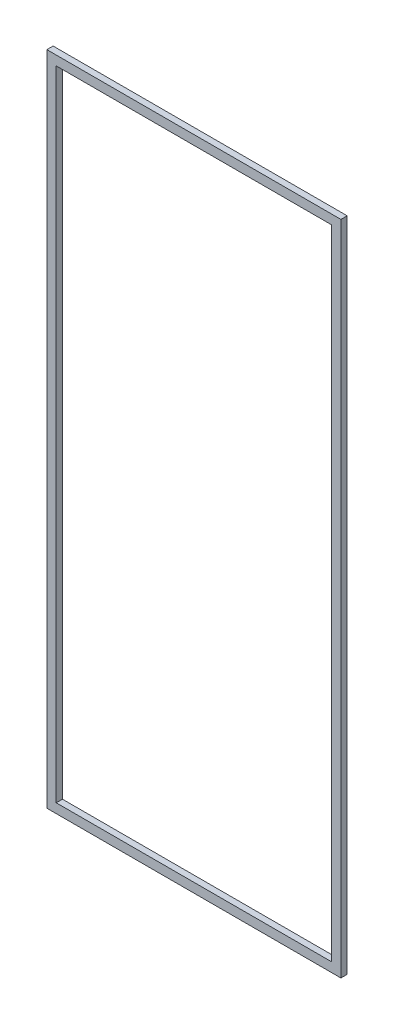
ISO-10303-21;
HEADER;
FILE_DESCRIPTION(('STEP AP214'),'2;1');
FILE_NAME('part.step','',(''),(''),'','','');
FILE_SCHEMA(('AUTOMOTIVE_DESIGN { 1 0 10303 214 1 1 1 1 }'));
ENDSEC;
DATA;
#1=APPLICATION_CONTEXT('core data for automotive mechanical design processes');
#2=APPLICATION_PROTOCOL_DEFINITION('international standard','automotive_design',2000,#1);
#3=PRODUCT_CONTEXT('',#1,'mechanical');
#4=PRODUCT('Part','Part','',(#3));
#5=PRODUCT_RELATED_PRODUCT_CATEGORY('part','',(#4));
#6=PRODUCT_DEFINITION_FORMATION('','',#4);
#7=PRODUCT_DEFINITION_CONTEXT('part definition',#1,'design');
#8=PRODUCT_DEFINITION('design','',#6,#7);
#9=PRODUCT_DEFINITION_SHAPE('','',#8);
#10=(LENGTH_UNIT() NAMED_UNIT(*) SI_UNIT(.MILLI.,.METRE.));
#11=(NAMED_UNIT(*) PLANE_ANGLE_UNIT() SI_UNIT($,.RADIAN.));
#12=(NAMED_UNIT(*) SI_UNIT($,.STERADIAN.) SOLID_ANGLE_UNIT());
#13=UNCERTAINTY_MEASURE_WITH_UNIT(LENGTH_MEASURE(1.E-05),#10,'distance_accuracy_value','');
#14=(GEOMETRIC_REPRESENTATION_CONTEXT(3) GLOBAL_UNCERTAINTY_ASSIGNED_CONTEXT((#13)) GLOBAL_UNIT_ASSIGNED_CONTEXT((#10,
#11,#12)) REPRESENTATION_CONTEXT('',''));
#15=CARTESIAN_POINT('',(0.,0.,0.));
#16=DIRECTION('',(0.,0.,1.));
#17=DIRECTION('',(1.,0.,0.));
#18=AXIS2_PLACEMENT_3D('',#15,#16,#17);
#19=CARTESIAN_POINT('',(0.,0.,10.));
#20=DIRECTION('',(0.,0.,1.));
#21=DIRECTION('',(1.,0.,0.));
#22=AXIS2_PLACEMENT_3D('',#19,#20,#21);
#23=PLANE('',#22);
#24=DIRECTION('',(0.,1.,0.));
#25=VECTOR('',#24,1.);
#26=CARTESIAN_POINT('',(235.,525.,10.));
#27=LINE('',#26,#25);
#28=CARTESIAN_POINT('',(235.,-525.,10.));
#29=VERTEX_POINT('',#28);
#30=CARTESIAN_POINT('',(235.,525.,10.));
#31=VERTEX_POINT('',#30);
#32=EDGE_CURVE('E159',#29,#31,#27,.T.);
#33=ORIENTED_EDGE('',*,*,#32,.T.);
#34=DIRECTION('',(-1.,0.,0.));
#35=VECTOR('',#34,1.);
#36=CARTESIAN_POINT('',(-235.,525.,10.));
#37=LINE('',#36,#35);
#38=CARTESIAN_POINT('',(-235.,525.,10.));
#39=VERTEX_POINT('',#38);
#40=EDGE_CURVE('E162',#31,#39,#37,.T.);
#41=ORIENTED_EDGE('',*,*,#40,.T.);
#42=DIRECTION('',(0.,-1.,0.));
#43=VECTOR('',#42,1.);
#44=CARTESIAN_POINT('',(-235.,525.,10.));
#45=LINE('',#44,#43);
#46=CARTESIAN_POINT('',(-235.,-525.,10.));
#47=VERTEX_POINT('',#46);
#48=EDGE_CURVE('E165',#39,#47,#45,.T.);
#49=ORIENTED_EDGE('',*,*,#48,.T.);
#50=DIRECTION('',(1.,0.,0.));
#51=VECTOR('',#50,1.);
#52=CARTESIAN_POINT('',(-235.,-525.,10.));
#53=LINE('',#52,#51);
#54=EDGE_CURVE('E167',#47,#29,#53,.T.);
#55=ORIENTED_EDGE('',*,*,#54,.T.);
#56=EDGE_LOOP('',(#33,#41,#49,#55));
#57=FACE_BOUND('',#56,.T.);
#58=DIRECTION('',(-1.,0.,0.));
#59=VECTOR('',#58,1.);
#60=CARTESIAN_POINT('',(-235.,510.,10.));
#61=LINE('',#60,#59);
#62=CARTESIAN_POINT('',(220.,510.,10.));
#63=VERTEX_POINT('',#62);
#64=CARTESIAN_POINT('',(-220.,510.,10.));
#65=VERTEX_POINT('',#64);
#66=EDGE_CURVE('E131',#63,#65,#61,.T.);
#67=ORIENTED_EDGE('',*,*,#66,.F.);
#68=DIRECTION('',(0.,1.,0.));
#69=VECTOR('',#68,1.);
#70=CARTESIAN_POINT('',(220.,525.,10.));
#71=LINE('',#70,#69);
#72=CARTESIAN_POINT('',(220.,-510.,10.));
#73=VERTEX_POINT('',#72);
#74=EDGE_CURVE('E123',#73,#63,#71,.T.);
#75=ORIENTED_EDGE('',*,*,#74,.F.);
#76=DIRECTION('',(1.,0.,0.));
#77=VECTOR('',#76,1.);
#78=CARTESIAN_POINT('',(-235.,-510.,10.));
#79=LINE('',#78,#77);
#80=CARTESIAN_POINT('',(-220.,-510.,10.));
#81=VERTEX_POINT('',#80);
#82=EDGE_CURVE('E145',#81,#73,#79,.T.);
#83=ORIENTED_EDGE('',*,*,#82,.F.);
#84=DIRECTION('',(0.,-1.,0.));
#85=VECTOR('',#84,1.);
#86=CARTESIAN_POINT('',(-220.,525.,10.));
#87=LINE('',#86,#85);
#88=EDGE_CURVE('E143',#65,#81,#87,.T.);
#89=ORIENTED_EDGE('',*,*,#88,.F.);
#90=EDGE_LOOP('',(#67,#75,#83,#89));
#91=FACE_BOUND('',#90,.T.);
#92=ADVANCED_FACE('F58',(#57,#91),#23,.T.);
#93=CARTESIAN_POINT('',(0.,0.,0.));
#94=DIRECTION('',(0.,0.,1.));
#95=DIRECTION('',(1.,0.,0.));
#96=AXIS2_PLACEMENT_3D('',#93,#94,#95);
#97=PLANE('',#96);
#98=DIRECTION('',(0.,1.,0.));
#99=VECTOR('',#98,1.);
#100=CARTESIAN_POINT('',(235.,525.,0.));
#101=LINE('',#100,#99);
#102=CARTESIAN_POINT('',(235.,-525.,0.));
#103=VERTEX_POINT('',#102);
#104=CARTESIAN_POINT('',(235.,525.,0.));
#105=VERTEX_POINT('',#104);
#106=EDGE_CURVE('E139',#103,#105,#101,.T.);
#107=ORIENTED_EDGE('',*,*,#106,.F.);
#108=DIRECTION('',(1.,0.,0.));
#109=VECTOR('',#108,1.);
#110=CARTESIAN_POINT('',(-235.,-525.,0.));
#111=LINE('',#110,#109);
#112=CARTESIAN_POINT('',(-235.,-525.,0.));
#113=VERTEX_POINT('',#112);
#114=EDGE_CURVE('E163',#113,#103,#111,.T.);
#115=ORIENTED_EDGE('',*,*,#114,.F.);
#116=DIRECTION('',(0.,-1.,0.));
#117=VECTOR('',#116,1.);
#118=CARTESIAN_POINT('',(-235.,525.,0.));
#119=LINE('',#118,#117);
#120=CARTESIAN_POINT('',(-235.,525.,0.));
#121=VERTEX_POINT('',#120);
#122=EDGE_CURVE('E174',#121,#113,#119,.T.);
#123=ORIENTED_EDGE('',*,*,#122,.F.);
#124=DIRECTION('',(-1.,0.,0.));
#125=VECTOR('',#124,1.);
#126=CARTESIAN_POINT('',(-235.,525.,0.));
#127=LINE('',#126,#125);
#128=EDGE_CURVE('E172',#105,#121,#127,.T.);
#129=ORIENTED_EDGE('',*,*,#128,.F.);
#130=EDGE_LOOP('',(#107,#115,#123,#129));
#131=FACE_BOUND('',#130,.T.);
#132=DIRECTION('',(0.,1.,0.));
#133=VECTOR('',#132,1.);
#134=CARTESIAN_POINT('',(220.,525.,0.));
#135=LINE('',#134,#133);
#136=CARTESIAN_POINT('',(220.,-510.,0.));
#137=VERTEX_POINT('',#136);
#138=CARTESIAN_POINT('',(220.,510.,0.));
#139=VERTEX_POINT('',#138);
#140=EDGE_CURVE('E81',#137,#139,#135,.T.);
#141=ORIENTED_EDGE('',*,*,#140,.T.);
#142=DIRECTION('',(-1.,0.,0.));
#143=VECTOR('',#142,1.);
#144=CARTESIAN_POINT('',(-235.,510.,0.));
#145=LINE('',#144,#143);
#146=CARTESIAN_POINT('',(-220.,510.,0.));
#147=VERTEX_POINT('',#146);
#148=EDGE_CURVE('E138',#139,#147,#145,.T.);
#149=ORIENTED_EDGE('',*,*,#148,.T.);
#150=DIRECTION('',(0.,-1.,0.));
#151=VECTOR('',#150,1.);
#152=CARTESIAN_POINT('',(-220.,525.,0.));
#153=LINE('',#152,#151);
#154=CARTESIAN_POINT('',(-220.,-510.,0.));
#155=VERTEX_POINT('',#154);
#156=EDGE_CURVE('E151',#147,#155,#153,.T.);
#157=ORIENTED_EDGE('',*,*,#156,.T.);
#158=DIRECTION('',(1.,0.,0.));
#159=VECTOR('',#158,1.);
#160=CARTESIAN_POINT('',(-235.,-510.,0.));
#161=LINE('',#160,#159);
#162=EDGE_CURVE('E132',#155,#137,#161,.T.);
#163=ORIENTED_EDGE('',*,*,#162,.T.);
#164=EDGE_LOOP('',(#141,#149,#157,#163));
#165=FACE_BOUND('',#164,.T.);
#166=ADVANCED_FACE('F192',(#131,#165),#97,.F.);
#167=CARTESIAN_POINT('',(235.,525.,10.));
#168=DIRECTION('',(-1.,0.,0.));
#169=DIRECTION('',(0.,-1.,0.));
#170=AXIS2_PLACEMENT_3D('',#167,#168,#169);
#171=PLANE('',#170);
#172=ORIENTED_EDGE('',*,*,#106,.T.);
#173=DIRECTION('',(0.,0.,-1.));
#174=VECTOR('',#173,1.);
#175=CARTESIAN_POINT('',(235.,525.,10.));
#176=LINE('',#175,#174);
#177=EDGE_CURVE('E12',#31,#105,#176,.T.);
#178=ORIENTED_EDGE('',*,*,#177,.F.);
#179=ORIENTED_EDGE('',*,*,#32,.F.);
#180=DIRECTION('',(0.,0.,-1.));
#181=VECTOR('',#180,1.);
#182=CARTESIAN_POINT('',(235.,-525.,10.));
#183=LINE('',#182,#181);
#184=EDGE_CURVE('E169',#29,#103,#183,.T.);
#185=ORIENTED_EDGE('',*,*,#184,.T.);
#186=EDGE_LOOP('',(#172,#178,#179,#185));
#187=FACE_BOUND('',#186,.T.);
#188=ADVANCED_FACE('F60',(#187),#171,.F.);
#189=CARTESIAN_POINT('',(-235.,525.,10.));
#190=DIRECTION('',(0.,-1.,0.));
#191=DIRECTION('',(0.,0.,-1.));
#192=AXIS2_PLACEMENT_3D('',#189,#190,#191);
#193=PLANE('',#192);
#194=ORIENTED_EDGE('',*,*,#128,.T.);
#195=DIRECTION('',(0.,0.,-1.));
#196=VECTOR('',#195,1.);
#197=CARTESIAN_POINT('',(-235.,525.,10.));
#198=LINE('',#197,#196);
#199=EDGE_CURVE('E66',#39,#121,#198,.T.);
#200=ORIENTED_EDGE('',*,*,#199,.F.);
#201=ORIENTED_EDGE('',*,*,#40,.F.);
#202=ORIENTED_EDGE('',*,*,#177,.T.);
#203=EDGE_LOOP('',(#194,#200,#201,#202));
#204=FACE_BOUND('',#203,.T.);
#205=ADVANCED_FACE('F202',(#204),#193,.F.);
#206=CARTESIAN_POINT('',(-235.,525.,10.));
#207=DIRECTION('',(1.,0.,0.));
#208=DIRECTION('',(0.,1.,0.));
#209=AXIS2_PLACEMENT_3D('',#206,#207,#208);
#210=PLANE('',#209);
#211=ORIENTED_EDGE('',*,*,#122,.T.);
#212=DIRECTION('',(0.,0.,-1.));
#213=VECTOR('',#212,1.);
#214=CARTESIAN_POINT('',(-235.,-525.,10.));
#215=LINE('',#214,#213);
#216=EDGE_CURVE('E179',#47,#113,#215,.T.);
#217=ORIENTED_EDGE('',*,*,#216,.F.);
#218=ORIENTED_EDGE('',*,*,#48,.F.);
#219=ORIENTED_EDGE('',*,*,#199,.T.);
#220=EDGE_LOOP('',(#211,#217,#218,#219));
#221=FACE_BOUND('',#220,.T.);
#222=ADVANCED_FACE('F186',(#221),#210,.F.);
#223=CARTESIAN_POINT('',(-235.,-525.,10.));
#224=DIRECTION('',(0.,1.,0.));
#225=DIRECTION('',(0.,0.,1.));
#226=AXIS2_PLACEMENT_3D('',#223,#224,#225);
#227=PLANE('',#226);
#228=ORIENTED_EDGE('',*,*,#114,.T.);
#229=ORIENTED_EDGE('',*,*,#184,.F.);
#230=ORIENTED_EDGE('',*,*,#54,.F.);
#231=ORIENTED_EDGE('',*,*,#216,.T.);
#232=EDGE_LOOP('',(#228,#229,#230,#231));
#233=FACE_BOUND('',#232,.T.);
#234=ADVANCED_FACE('F196',(#233),#227,.F.);
#235=CARTESIAN_POINT('',(220.,525.,10.));
#236=DIRECTION('',(-1.,0.,0.));
#237=DIRECTION('',(0.,-1.,0.));
#238=AXIS2_PLACEMENT_3D('',#235,#236,#237);
#239=PLANE('',#238);
#240=ORIENTED_EDGE('',*,*,#140,.F.);
#241=DIRECTION('',(0.,0.,-1.));
#242=VECTOR('',#241,1.);
#243=CARTESIAN_POINT('',(220.,-510.,10.));
#244=LINE('',#243,#242);
#245=EDGE_CURVE('E127',#73,#137,#244,.T.);
#246=ORIENTED_EDGE('',*,*,#245,.F.);
#247=ORIENTED_EDGE('',*,*,#74,.T.);
#248=DIRECTION('',(0.,0.,-1.));
#249=VECTOR('',#248,1.);
#250=CARTESIAN_POINT('',(220.,510.,10.));
#251=LINE('',#250,#249);
#252=EDGE_CURVE('E126',#63,#139,#251,.T.);
#253=ORIENTED_EDGE('',*,*,#252,.T.);
#254=EDGE_LOOP('',(#240,#246,#247,#253));
#255=FACE_BOUND('',#254,.T.);
#256=ADVANCED_FACE('F125',(#255),#239,.T.);
#257=CARTESIAN_POINT('',(-235.,510.,10.));
#258=DIRECTION('',(0.,-1.,0.));
#259=DIRECTION('',(0.,0.,-1.));
#260=AXIS2_PLACEMENT_3D('',#257,#258,#259);
#261=PLANE('',#260);
#262=ORIENTED_EDGE('',*,*,#148,.F.);
#263=ORIENTED_EDGE('',*,*,#252,.F.);
#264=ORIENTED_EDGE('',*,*,#66,.T.);
#265=DIRECTION('',(0.,0.,-1.));
#266=VECTOR('',#265,1.);
#267=CARTESIAN_POINT('',(-220.,510.,10.));
#268=LINE('',#267,#266);
#269=EDGE_CURVE('E140',#65,#147,#268,.T.);
#270=ORIENTED_EDGE('',*,*,#269,.T.);
#271=EDGE_LOOP('',(#262,#263,#264,#270));
#272=FACE_BOUND('',#271,.T.);
#273=ADVANCED_FACE('F135',(#272),#261,.T.);
#274=CARTESIAN_POINT('',(-220.,525.,10.));
#275=DIRECTION('',(1.,0.,0.));
#276=DIRECTION('',(0.,1.,0.));
#277=AXIS2_PLACEMENT_3D('',#274,#275,#276);
#278=PLANE('',#277);
#279=ORIENTED_EDGE('',*,*,#156,.F.);
#280=ORIENTED_EDGE('',*,*,#269,.F.);
#281=ORIENTED_EDGE('',*,*,#88,.T.);
#282=DIRECTION('',(0.,0.,-1.));
#283=VECTOR('',#282,1.);
#284=CARTESIAN_POINT('',(-220.,-510.,10.));
#285=LINE('',#284,#283);
#286=EDGE_CURVE('E73',#81,#155,#285,.T.);
#287=ORIENTED_EDGE('',*,*,#286,.T.);
#288=EDGE_LOOP('',(#279,#280,#281,#287));
#289=FACE_BOUND('',#288,.T.);
#290=ADVANCED_FACE('F225',(#289),#278,.T.);
#291=CARTESIAN_POINT('',(-235.,-510.,10.));
#292=DIRECTION('',(0.,1.,0.));
#293=DIRECTION('',(0.,0.,1.));
#294=AXIS2_PLACEMENT_3D('',#291,#292,#293);
#295=PLANE('',#294);
#296=ORIENTED_EDGE('',*,*,#162,.F.);
#297=ORIENTED_EDGE('',*,*,#286,.F.);
#298=ORIENTED_EDGE('',*,*,#82,.T.);
#299=ORIENTED_EDGE('',*,*,#245,.T.);
#300=EDGE_LOOP('',(#296,#297,#298,#299));
#301=FACE_BOUND('',#300,.T.);
#302=ADVANCED_FACE('F229',(#301),#295,.T.);
#303=CLOSED_SHELL('',(#92,#166,#188,#205,#222,#234,#256,#273,#290,#302));
#304=MANIFOLD_SOLID_BREP('B2',#303);
#305=ADVANCED_BREP_SHAPE_REPRESENTATION('',(#18,#304),#14);
#306=SHAPE_DEFINITION_REPRESENTATION(#9,#305);
ENDSEC;
END-ISO-10303-21;
